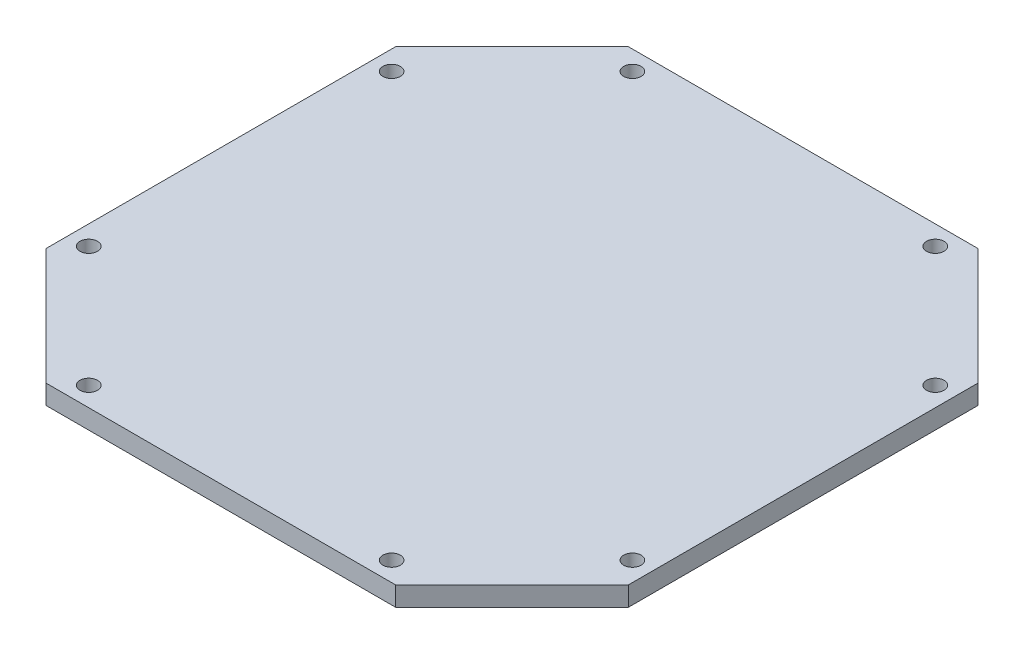
ISO-10303-21;
HEADER;
FILE_DESCRIPTION(('STEP AP214'),'2;1');
FILE_NAME('part.step','',(''),(''),'','','');
FILE_SCHEMA(('AUTOMOTIVE_DESIGN { 1 0 10303 214 1 1 1 1 }'));
ENDSEC;
DATA;
#1=APPLICATION_CONTEXT('core data for automotive mechanical design processes');
#2=APPLICATION_PROTOCOL_DEFINITION('international standard','automotive_design',2000,#1);
#3=PRODUCT_CONTEXT('',#1,'mechanical');
#4=PRODUCT('Part','Part','',(#3));
#5=PRODUCT_RELATED_PRODUCT_CATEGORY('part','',(#4));
#6=PRODUCT_DEFINITION_FORMATION('','',#4);
#7=PRODUCT_DEFINITION_CONTEXT('part definition',#1,'design');
#8=PRODUCT_DEFINITION('design','',#6,#7);
#9=PRODUCT_DEFINITION_SHAPE('','',#8);
#10=(LENGTH_UNIT() NAMED_UNIT(*) SI_UNIT(.MILLI.,.METRE.));
#11=(NAMED_UNIT(*) PLANE_ANGLE_UNIT() SI_UNIT($,.RADIAN.));
#12=(NAMED_UNIT(*) SI_UNIT($,.STERADIAN.) SOLID_ANGLE_UNIT());
#13=UNCERTAINTY_MEASURE_WITH_UNIT(LENGTH_MEASURE(1.E-05),#10,'distance_accuracy_value','');
#14=(GEOMETRIC_REPRESENTATION_CONTEXT(3) GLOBAL_UNCERTAINTY_ASSIGNED_CONTEXT((#13)) GLOBAL_UNIT_ASSIGNED_CONTEXT((#10,
#11,#12)) REPRESENTATION_CONTEXT('',''));
#15=CARTESIAN_POINT('',(0.,0.,0.));
#16=DIRECTION('',(0.,0.,1.));
#17=DIRECTION('',(1.,0.,0.));
#18=AXIS2_PLACEMENT_3D('',#15,#16,#17);
#19=CARTESIAN_POINT('',(-86.0912052117265,10.,-150.488599348534));
#20=DIRECTION('',(0.,0.,1.));
#21=DIRECTION('',(1.,0.,0.));
#22=AXIS2_PLACEMENT_3D('',#19,#20,#21);
#23=PLANE('',#22);
#24=DIRECTION('',(-1.,0.,0.));
#25=VECTOR('',#24,1.);
#26=CARTESIAN_POINT('',(-86.0912052117265,0.,-150.488599348534));
#27=LINE('',#26,#25);
#28=CARTESIAN_POINT('',(93.9087947882735,0.,-150.488599348534));
#29=VERTEX_POINT('',#28);
#30=CARTESIAN_POINT('',(-86.0912052117265,0.,-150.488599348534));
#31=VERTEX_POINT('',#30);
#32=EDGE_CURVE('E144',#29,#31,#27,.T.);
#33=ORIENTED_EDGE('',*,*,#32,.T.);
#34=DIRECTION('',(0.,-1.,0.));
#35=VECTOR('',#34,1.);
#36=CARTESIAN_POINT('',(-86.0912052117265,10.,-150.488599348534));
#37=LINE('',#36,#35);
#38=CARTESIAN_POINT('',(-86.0912052117265,10.,-150.488599348534));
#39=VERTEX_POINT('',#38);
#40=EDGE_CURVE('E11',#39,#31,#37,.T.);
#41=ORIENTED_EDGE('',*,*,#40,.F.);
#42=DIRECTION('',(-1.,0.,0.));
#43=VECTOR('',#42,1.);
#44=CARTESIAN_POINT('',(-86.0912052117265,10.,-150.488599348534));
#45=LINE('',#44,#43);
#46=CARTESIAN_POINT('',(93.9087947882735,10.,-150.488599348534));
#47=VERTEX_POINT('',#46);
#48=EDGE_CURVE('E167',#47,#39,#45,.T.);
#49=ORIENTED_EDGE('',*,*,#48,.F.);
#50=DIRECTION('',(0.,-1.,0.));
#51=VECTOR('',#50,1.);
#52=CARTESIAN_POINT('',(93.9087947882735,10.,-150.488599348534));
#53=LINE('',#52,#51);
#54=EDGE_CURVE('E140',#47,#29,#53,.T.);
#55=ORIENTED_EDGE('',*,*,#54,.T.);
#56=EDGE_LOOP('',(#33,#41,#49,#55));
#57=FACE_BOUND('',#56,.T.);
#58=ADVANCED_FACE('F43',(#57),#23,.F.);
#59=CARTESIAN_POINT('',(-146.091205211726,10.,-90.4885993485344));
#60=DIRECTION('',(0.707106781186546,0.,0.707106781186549));
#61=DIRECTION('',(0.707106781186549,0.,-0.707106781186546));
#62=AXIS2_PLACEMENT_3D('',#59,#60,#61);
#63=PLANE('',#62);
#64=DIRECTION('',(-0.707106781186549,0.,0.707106781186546));
#65=VECTOR('',#64,1.);
#66=CARTESIAN_POINT('',(-146.091205211726,0.,-90.4885993485344));
#67=LINE('',#66,#65);
#68=CARTESIAN_POINT('',(-146.091205211726,0.,-90.4885993485344));
#69=VERTEX_POINT('',#68);
#70=EDGE_CURVE('E148',#31,#69,#67,.T.);
#71=ORIENTED_EDGE('',*,*,#70,.T.);
#72=DIRECTION('',(0.,-1.,0.));
#73=VECTOR('',#72,1.);
#74=CARTESIAN_POINT('',(-146.091205211726,10.,-90.4885993485344));
#75=LINE('',#74,#73);
#76=CARTESIAN_POINT('',(-146.091205211726,10.,-90.4885993485344));
#77=VERTEX_POINT('',#76);
#78=EDGE_CURVE('E52',#77,#69,#75,.T.);
#79=ORIENTED_EDGE('',*,*,#78,.F.);
#80=DIRECTION('',(-0.707106781186549,0.,0.707106781186546));
#81=VECTOR('',#80,1.);
#82=CARTESIAN_POINT('',(-146.091205211726,10.,-90.4885993485344));
#83=LINE('',#82,#81);
#84=EDGE_CURVE('E103',#39,#77,#83,.T.);
#85=ORIENTED_EDGE('',*,*,#84,.F.);
#86=ORIENTED_EDGE('',*,*,#40,.T.);
#87=EDGE_LOOP('',(#71,#79,#85,#86));
#88=FACE_BOUND('',#87,.T.);
#89=ADVANCED_FACE('F311',(#88),#63,.F.);
#90=CARTESIAN_POINT('',(-146.091205211726,10.,-90.4885993485344));
#91=DIRECTION('',(1.,0.,0.));
#92=DIRECTION('',(0.,0.,-1.));
#93=AXIS2_PLACEMENT_3D('',#90,#91,#92);
#94=PLANE('',#93);
#95=DIRECTION('',(0.,0.,1.));
#96=VECTOR('',#95,1.);
#97=CARTESIAN_POINT('',(-146.091205211726,0.,-90.4885993485344));
#98=LINE('',#97,#96);
#99=CARTESIAN_POINT('',(-146.091205211726,0.,89.5114006514658));
#100=VERTEX_POINT('',#99);
#101=EDGE_CURVE('E152',#69,#100,#98,.T.);
#102=ORIENTED_EDGE('',*,*,#101,.T.);
#103=DIRECTION('',(0.,-1.,0.));
#104=VECTOR('',#103,1.);
#105=CARTESIAN_POINT('',(-146.091205211726,10.,89.5114006514658));
#106=LINE('',#105,#104);
#107=CARTESIAN_POINT('',(-146.091205211726,10.,89.5114006514658));
#108=VERTEX_POINT('',#107);
#109=EDGE_CURVE('E178',#108,#100,#106,.T.);
#110=ORIENTED_EDGE('',*,*,#109,.F.);
#111=DIRECTION('',(0.,0.,1.));
#112=VECTOR('',#111,1.);
#113=CARTESIAN_POINT('',(-146.091205211726,10.,-90.4885993485344));
#114=LINE('',#113,#112);
#115=EDGE_CURVE('E188',#77,#108,#114,.T.);
#116=ORIENTED_EDGE('',*,*,#115,.F.);
#117=ORIENTED_EDGE('',*,*,#78,.T.);
#118=EDGE_LOOP('',(#102,#110,#116,#117));
#119=FACE_BOUND('',#118,.T.);
#120=ADVANCED_FACE('F186',(#119),#94,.F.);
#121=CARTESIAN_POINT('',(-146.091205211726,10.,89.5114006514658));
#122=DIRECTION('',(0.707106781186549,0.,-0.707106781186546));
#123=DIRECTION('',(-0.707106781186546,0.,-0.707106781186549));
#124=AXIS2_PLACEMENT_3D('',#121,#122,#123);
#125=PLANE('',#124);
#126=DIRECTION('',(0.707106781186546,0.,0.707106781186549));
#127=VECTOR('',#126,1.);
#128=CARTESIAN_POINT('',(-146.091205211726,0.,89.5114006514658));
#129=LINE('',#128,#127);
#130=CARTESIAN_POINT('',(-86.0912052117266,0.,149.511400651466));
#131=VERTEX_POINT('',#130);
#132=EDGE_CURVE('E155',#100,#131,#129,.T.);
#133=ORIENTED_EDGE('',*,*,#132,.T.);
#134=DIRECTION('',(0.,-1.,0.));
#135=VECTOR('',#134,1.);
#136=CARTESIAN_POINT('',(-86.0912052117266,10.,149.511400651466));
#137=LINE('',#136,#135);
#138=CARTESIAN_POINT('',(-86.0912052117266,10.,149.511400651466));
#139=VERTEX_POINT('',#138);
#140=EDGE_CURVE('E174',#139,#131,#137,.T.);
#141=ORIENTED_EDGE('',*,*,#140,.F.);
#142=DIRECTION('',(0.707106781186546,0.,0.707106781186549));
#143=VECTOR('',#142,1.);
#144=CARTESIAN_POINT('',(-146.091205211726,10.,89.5114006514658));
#145=LINE('',#144,#143);
#146=EDGE_CURVE('E201',#108,#139,#145,.T.);
#147=ORIENTED_EDGE('',*,*,#146,.F.);
#148=ORIENTED_EDGE('',*,*,#109,.T.);
#149=EDGE_LOOP('',(#133,#141,#147,#148));
#150=FACE_BOUND('',#149,.T.);
#151=ADVANCED_FACE('F196',(#150),#125,.F.);
#152=CARTESIAN_POINT('',(-86.0912052117266,10.,149.511400651466));
#153=DIRECTION('',(0.,0.,-1.));
#154=DIRECTION('',(-1.,0.,0.));
#155=AXIS2_PLACEMENT_3D('',#152,#153,#154);
#156=PLANE('',#155);
#157=DIRECTION('',(1.,0.,0.));
#158=VECTOR('',#157,1.);
#159=CARTESIAN_POINT('',(-86.0912052117266,0.,149.511400651466));
#160=LINE('',#159,#158);
#161=CARTESIAN_POINT('',(93.9087947882736,0.,149.511400651466));
#162=VERTEX_POINT('',#161);
#163=EDGE_CURVE('E158',#131,#162,#160,.T.);
#164=ORIENTED_EDGE('',*,*,#163,.T.);
#165=DIRECTION('',(0.,-1.,0.));
#166=VECTOR('',#165,1.);
#167=CARTESIAN_POINT('',(93.9087947882736,10.,149.511400651466));
#168=LINE('',#167,#166);
#169=CARTESIAN_POINT('',(93.9087947882736,10.,149.511400651466));
#170=VERTEX_POINT('',#169);
#171=EDGE_CURVE('E133',#170,#162,#168,.T.);
#172=ORIENTED_EDGE('',*,*,#171,.F.);
#173=DIRECTION('',(1.,0.,0.));
#174=VECTOR('',#173,1.);
#175=CARTESIAN_POINT('',(-86.0912052117266,10.,149.511400651466));
#176=LINE('',#175,#174);
#177=EDGE_CURVE('E122',#139,#170,#176,.T.);
#178=ORIENTED_EDGE('',*,*,#177,.F.);
#179=ORIENTED_EDGE('',*,*,#140,.T.);
#180=EDGE_LOOP('',(#164,#172,#178,#179));
#181=FACE_BOUND('',#180,.T.);
#182=ADVANCED_FACE('F199',(#181),#156,.F.);
#183=CARTESIAN_POINT('',(93.9087947882736,10.,149.511400651466));
#184=DIRECTION('',(-0.707106781186546,0.,-0.707106781186549));
#185=DIRECTION('',(-0.707106781186549,0.,0.707106781186546));
#186=AXIS2_PLACEMENT_3D('',#183,#184,#185);
#187=PLANE('',#186);
#188=DIRECTION('',(0.707106781186549,0.,-0.707106781186546));
#189=VECTOR('',#188,1.);
#190=CARTESIAN_POINT('',(93.9087947882736,0.,149.511400651466));
#191=LINE('',#190,#189);
#192=CARTESIAN_POINT('',(153.908794788274,0.,89.511400651466));
#193=VERTEX_POINT('',#192);
#194=EDGE_CURVE('E131',#162,#193,#191,.T.);
#195=ORIENTED_EDGE('',*,*,#194,.T.);
#196=DIRECTION('',(0.,-1.,0.));
#197=VECTOR('',#196,1.);
#198=CARTESIAN_POINT('',(153.908794788274,10.,89.511400651466));
#199=LINE('',#198,#197);
#200=CARTESIAN_POINT('',(153.908794788274,10.,89.511400651466));
#201=VERTEX_POINT('',#200);
#202=EDGE_CURVE('E128',#201,#193,#199,.T.);
#203=ORIENTED_EDGE('',*,*,#202,.F.);
#204=DIRECTION('',(0.707106781186549,0.,-0.707106781186546));
#205=VECTOR('',#204,1.);
#206=CARTESIAN_POINT('',(93.9087947882736,10.,149.511400651466));
#207=LINE('',#206,#205);
#208=EDGE_CURVE('E116',#170,#201,#207,.T.);
#209=ORIENTED_EDGE('',*,*,#208,.F.);
#210=ORIENTED_EDGE('',*,*,#171,.T.);
#211=EDGE_LOOP('',(#195,#203,#209,#210));
#212=FACE_BOUND('',#211,.T.);
#213=ADVANCED_FACE('F129',(#212),#187,.F.);
#214=CARTESIAN_POINT('',(153.908794788274,10.,-90.4885993485344));
#215=DIRECTION('',(-1.,0.,0.));
#216=DIRECTION('',(0.,0.,1.));
#217=AXIS2_PLACEMENT_3D('',#214,#215,#216);
#218=PLANE('',#217);
#219=DIRECTION('',(0.,0.,-1.));
#220=VECTOR('',#219,1.);
#221=CARTESIAN_POINT('',(153.908794788274,0.,-90.4885993485344));
#222=LINE('',#221,#220);
#223=CARTESIAN_POINT('',(153.908794788274,0.,-90.4885993485344));
#224=VERTEX_POINT('',#223);
#225=EDGE_CURVE('E89',#193,#224,#222,.T.);
#226=ORIENTED_EDGE('',*,*,#225,.T.);
#227=DIRECTION('',(0.,-1.,0.));
#228=VECTOR('',#227,1.);
#229=CARTESIAN_POINT('',(153.908794788274,10.,-90.4885993485344));
#230=LINE('',#229,#228);
#231=CARTESIAN_POINT('',(153.908794788274,10.,-90.4885993485344));
#232=VERTEX_POINT('',#231);
#233=EDGE_CURVE('E134',#232,#224,#230,.T.);
#234=ORIENTED_EDGE('',*,*,#233,.F.);
#235=DIRECTION('',(0.,0.,-1.));
#236=VECTOR('',#235,1.);
#237=CARTESIAN_POINT('',(153.908794788274,10.,-90.4885993485344));
#238=LINE('',#237,#236);
#239=EDGE_CURVE('E120',#201,#232,#238,.T.);
#240=ORIENTED_EDGE('',*,*,#239,.F.);
#241=ORIENTED_EDGE('',*,*,#202,.T.);
#242=EDGE_LOOP('',(#226,#234,#240,#241));
#243=FACE_BOUND('',#242,.T.);
#244=ADVANCED_FACE('F136',(#243),#218,.F.);
#245=CARTESIAN_POINT('',(93.9087947882735,10.,-150.488599348534));
#246=DIRECTION('',(-0.707106781186546,0.,0.707106781186549));
#247=DIRECTION('',(0.707106781186549,0.,0.707106781186546));
#248=AXIS2_PLACEMENT_3D('',#245,#246,#247);
#249=PLANE('',#248);
#250=DIRECTION('',(-0.707106781186549,0.,-0.707106781186546));
#251=VECTOR('',#250,1.);
#252=CARTESIAN_POINT('',(93.9087947882735,0.,-150.488599348534));
#253=LINE('',#252,#251);
#254=EDGE_CURVE('E95',#224,#29,#253,.T.);
#255=ORIENTED_EDGE('',*,*,#254,.T.);
#256=ORIENTED_EDGE('',*,*,#54,.F.);
#257=DIRECTION('',(-0.707106781186549,0.,-0.707106781186546));
#258=VECTOR('',#257,1.);
#259=CARTESIAN_POINT('',(93.9087947882735,10.,-150.488599348534));
#260=LINE('',#259,#258);
#261=EDGE_CURVE('E60',#232,#47,#260,.T.);
#262=ORIENTED_EDGE('',*,*,#261,.F.);
#263=ORIENTED_EDGE('',*,*,#233,.T.);
#264=EDGE_LOOP('',(#255,#256,#262,#263));
#265=FACE_BOUND('',#264,.T.);
#266=ADVANCED_FACE('F279',(#265),#249,.F.);
#267=CARTESIAN_POINT('',(0.,10.,0.));
#268=DIRECTION('',(0.,-1.,0.));
#269=DIRECTION('',(0.,0.,-1.));
#270=AXIS2_PLACEMENT_3D('',#267,#268,#269);
#271=PLANE('',#270);
#272=CARTESIAN_POINT('',(-136.091205211726,10.,-78.4885993485342));
#273=DIRECTION('',(0.,1.,0.));
#274=DIRECTION('',(0.,0.,1.));
#275=AXIS2_PLACEMENT_3D('',#272,#273,#274);
#276=CIRCLE('',#275,4.5);
#277=CARTESIAN_POINT('',(-136.091205211726,10.,-73.9885993485342));
#278=VERTEX_POINT('',#277);
#279=EDGE_CURVE('E270',#278,#278,#276,.T.);
#280=ORIENTED_EDGE('',*,*,#279,.F.);
#281=EDGE_LOOP('',(#280));
#282=FACE_BOUND('',#281,.T.);
#283=CARTESIAN_POINT('',(-74.0912052117264,10.,-140.488599348534));
#284=DIRECTION('',(0.,1.,0.));
#285=DIRECTION('',(0.,0.,1.));
#286=AXIS2_PLACEMENT_3D('',#283,#284,#285);
#287=CIRCLE('',#286,4.5);
#288=CARTESIAN_POINT('',(-74.0912052117264,10.,-135.988599348534));
#289=VERTEX_POINT('',#288);
#290=EDGE_CURVE('E262',#289,#289,#287,.T.);
#291=ORIENTED_EDGE('',*,*,#290,.F.);
#292=EDGE_LOOP('',(#291));
#293=FACE_BOUND('',#292,.T.);
#294=CARTESIAN_POINT('',(81.9087947882735,10.,-140.488599348534));
#295=DIRECTION('',(0.,1.,0.));
#296=DIRECTION('',(0.,0.,1.));
#297=AXIS2_PLACEMENT_3D('',#294,#295,#296);
#298=CIRCLE('',#297,4.5);
#299=CARTESIAN_POINT('',(81.9087947882735,10.,-135.988599348534));
#300=VERTEX_POINT('',#299);
#301=EDGE_CURVE('E254',#300,#300,#298,.T.);
#302=ORIENTED_EDGE('',*,*,#301,.F.);
#303=EDGE_LOOP('',(#302));
#304=FACE_BOUND('',#303,.T.);
#305=CARTESIAN_POINT('',(143.908794788274,10.,-78.4885993485342));
#306=DIRECTION('',(0.,1.,0.));
#307=DIRECTION('',(0.,0.,1.));
#308=AXIS2_PLACEMENT_3D('',#305,#306,#307);
#309=CIRCLE('',#308,4.5);
#310=CARTESIAN_POINT('',(143.908794788274,10.,-73.9885993485342));
#311=VERTEX_POINT('',#310);
#312=EDGE_CURVE('E246',#311,#311,#309,.T.);
#313=ORIENTED_EDGE('',*,*,#312,.F.);
#314=EDGE_LOOP('',(#313));
#315=FACE_BOUND('',#314,.T.);
#316=CARTESIAN_POINT('',(143.908794788274,10.,77.5114006514658));
#317=DIRECTION('',(0.,1.,0.));
#318=DIRECTION('',(0.,0.,1.));
#319=AXIS2_PLACEMENT_3D('',#316,#317,#318);
#320=CIRCLE('',#319,4.5);
#321=CARTESIAN_POINT('',(143.908794788274,10.,82.0114006514658));
#322=VERTEX_POINT('',#321);
#323=EDGE_CURVE('E238',#322,#322,#320,.T.);
#324=ORIENTED_EDGE('',*,*,#323,.F.);
#325=EDGE_LOOP('',(#324));
#326=FACE_BOUND('',#325,.T.);
#327=CARTESIAN_POINT('',(81.9087947882735,10.,139.511400651466));
#328=DIRECTION('',(0.,1.,0.));
#329=DIRECTION('',(0.,0.,1.));
#330=AXIS2_PLACEMENT_3D('',#327,#328,#329);
#331=CIRCLE('',#330,4.5);
#332=CARTESIAN_POINT('',(81.9087947882735,10.,144.011400651466));
#333=VERTEX_POINT('',#332);
#334=EDGE_CURVE('E230',#333,#333,#331,.T.);
#335=ORIENTED_EDGE('',*,*,#334,.F.);
#336=EDGE_LOOP('',(#335));
#337=FACE_BOUND('',#336,.T.);
#338=CARTESIAN_POINT('',(-74.0912052117264,10.,139.511400651466));
#339=DIRECTION('',(0.,1.,0.));
#340=DIRECTION('',(0.,0.,1.));
#341=AXIS2_PLACEMENT_3D('',#338,#339,#340);
#342=CIRCLE('',#341,4.5);
#343=CARTESIAN_POINT('',(-74.0912052117264,10.,144.011400651466));
#344=VERTEX_POINT('',#343);
#345=EDGE_CURVE('E222',#344,#344,#342,.T.);
#346=ORIENTED_EDGE('',*,*,#345,.F.);
#347=EDGE_LOOP('',(#346));
#348=FACE_BOUND('',#347,.T.);
#349=CARTESIAN_POINT('',(-136.091205211726,10.,77.5114006514658));
#350=DIRECTION('',(0.,1.,0.));
#351=DIRECTION('',(0.,0.,1.));
#352=AXIS2_PLACEMENT_3D('',#349,#350,#351);
#353=CIRCLE('',#352,4.5);
#354=CARTESIAN_POINT('',(-136.091205211726,10.,82.0114006514658));
#355=VERTEX_POINT('',#354);
#356=EDGE_CURVE('E214',#355,#355,#353,.T.);
#357=ORIENTED_EDGE('',*,*,#356,.F.);
#358=EDGE_LOOP('',(#357));
#359=FACE_BOUND('',#358,.T.);
#360=ORIENTED_EDGE('',*,*,#48,.T.);
#361=ORIENTED_EDGE('',*,*,#84,.T.);
#362=ORIENTED_EDGE('',*,*,#115,.T.);
#363=ORIENTED_EDGE('',*,*,#146,.T.);
#364=ORIENTED_EDGE('',*,*,#177,.T.);
#365=ORIENTED_EDGE('',*,*,#208,.T.);
#366=ORIENTED_EDGE('',*,*,#239,.T.);
#367=ORIENTED_EDGE('',*,*,#261,.T.);
#368=EDGE_LOOP('',(#360,#361,#362,#363,#364,#365,#366,#367));
#369=FACE_BOUND('',#368,.T.);
#370=ADVANCED_FACE('F118',(#282,#293,#304,#315,#326,#337,#348,#359,#369),#271,.F.);
#371=CARTESIAN_POINT('',(0.,0.,0.));
#372=DIRECTION('',(0.,-1.,0.));
#373=DIRECTION('',(0.,0.,-1.));
#374=AXIS2_PLACEMENT_3D('',#371,#372,#373);
#375=PLANE('',#374);
#376=CARTESIAN_POINT('',(-136.091205211726,0.,-78.4885993485342));
#377=DIRECTION('',(0.,1.,0.));
#378=DIRECTION('',(0.,0.,1.));
#379=AXIS2_PLACEMENT_3D('',#376,#377,#378);
#380=CIRCLE('',#379,4.5);
#381=CARTESIAN_POINT('',(-136.091205211726,0.,-73.9885993485342));
#382=VERTEX_POINT('',#381);
#383=EDGE_CURVE('E266',#382,#382,#380,.T.);
#384=ORIENTED_EDGE('',*,*,#383,.T.);
#385=EDGE_LOOP('',(#384));
#386=FACE_BOUND('',#385,.T.);
#387=CARTESIAN_POINT('',(-74.0912052117264,0.,-140.488599348534));
#388=DIRECTION('',(0.,1.,0.));
#389=DIRECTION('',(0.,0.,1.));
#390=AXIS2_PLACEMENT_3D('',#387,#388,#389);
#391=CIRCLE('',#390,4.5);
#392=CARTESIAN_POINT('',(-74.0912052117264,0.,-135.988599348534));
#393=VERTEX_POINT('',#392);
#394=EDGE_CURVE('E258',#393,#393,#391,.T.);
#395=ORIENTED_EDGE('',*,*,#394,.T.);
#396=EDGE_LOOP('',(#395));
#397=FACE_BOUND('',#396,.T.);
#398=CARTESIAN_POINT('',(81.9087947882735,0.,-140.488599348534));
#399=DIRECTION('',(0.,1.,0.));
#400=DIRECTION('',(0.,0.,1.));
#401=AXIS2_PLACEMENT_3D('',#398,#399,#400);
#402=CIRCLE('',#401,4.5);
#403=CARTESIAN_POINT('',(81.9087947882735,0.,-135.988599348534));
#404=VERTEX_POINT('',#403);
#405=EDGE_CURVE('E250',#404,#404,#402,.T.);
#406=ORIENTED_EDGE('',*,*,#405,.T.);
#407=EDGE_LOOP('',(#406));
#408=FACE_BOUND('',#407,.T.);
#409=CARTESIAN_POINT('',(143.908794788274,0.,-78.4885993485342));
#410=DIRECTION('',(0.,1.,0.));
#411=DIRECTION('',(0.,0.,1.));
#412=AXIS2_PLACEMENT_3D('',#409,#410,#411);
#413=CIRCLE('',#412,4.5);
#414=CARTESIAN_POINT('',(143.908794788274,0.,-73.9885993485342));
#415=VERTEX_POINT('',#414);
#416=EDGE_CURVE('E242',#415,#415,#413,.T.);
#417=ORIENTED_EDGE('',*,*,#416,.T.);
#418=EDGE_LOOP('',(#417));
#419=FACE_BOUND('',#418,.T.);
#420=CARTESIAN_POINT('',(143.908794788274,0.,77.5114006514658));
#421=DIRECTION('',(0.,1.,0.));
#422=DIRECTION('',(0.,0.,1.));
#423=AXIS2_PLACEMENT_3D('',#420,#421,#422);
#424=CIRCLE('',#423,4.5);
#425=CARTESIAN_POINT('',(143.908794788274,0.,82.0114006514658));
#426=VERTEX_POINT('',#425);
#427=EDGE_CURVE('E234',#426,#426,#424,.T.);
#428=ORIENTED_EDGE('',*,*,#427,.T.);
#429=EDGE_LOOP('',(#428));
#430=FACE_BOUND('',#429,.T.);
#431=CARTESIAN_POINT('',(81.9087947882735,0.,139.511400651466));
#432=DIRECTION('',(0.,1.,0.));
#433=DIRECTION('',(0.,0.,1.));
#434=AXIS2_PLACEMENT_3D('',#431,#432,#433);
#435=CIRCLE('',#434,4.5);
#436=CARTESIAN_POINT('',(81.9087947882735,0.,144.011400651466));
#437=VERTEX_POINT('',#436);
#438=EDGE_CURVE('E226',#437,#437,#435,.T.);
#439=ORIENTED_EDGE('',*,*,#438,.T.);
#440=EDGE_LOOP('',(#439));
#441=FACE_BOUND('',#440,.T.);
#442=CARTESIAN_POINT('',(-74.0912052117264,0.,139.511400651466));
#443=DIRECTION('',(0.,1.,0.));
#444=DIRECTION('',(0.,0.,1.));
#445=AXIS2_PLACEMENT_3D('',#442,#443,#444);
#446=CIRCLE('',#445,4.5);
#447=CARTESIAN_POINT('',(-74.0912052117264,0.,144.011400651466));
#448=VERTEX_POINT('',#447);
#449=EDGE_CURVE('E218',#448,#448,#446,.T.);
#450=ORIENTED_EDGE('',*,*,#449,.T.);
#451=EDGE_LOOP('',(#450));
#452=FACE_BOUND('',#451,.T.);
#453=CARTESIAN_POINT('',(-136.091205211726,0.,77.5114006514658));
#454=DIRECTION('',(0.,1.,0.));
#455=DIRECTION('',(0.,0.,1.));
#456=AXIS2_PLACEMENT_3D('',#453,#454,#455);
#457=CIRCLE('',#456,4.5);
#458=CARTESIAN_POINT('',(-136.091205211726,0.,82.0114006514658));
#459=VERTEX_POINT('',#458);
#460=EDGE_CURVE('E149',#459,#459,#457,.T.);
#461=ORIENTED_EDGE('',*,*,#460,.T.);
#462=EDGE_LOOP('',(#461));
#463=FACE_BOUND('',#462,.T.);
#464=ORIENTED_EDGE('',*,*,#32,.F.);
#465=ORIENTED_EDGE('',*,*,#254,.F.);
#466=ORIENTED_EDGE('',*,*,#225,.F.);
#467=ORIENTED_EDGE('',*,*,#194,.F.);
#468=ORIENTED_EDGE('',*,*,#163,.F.);
#469=ORIENTED_EDGE('',*,*,#132,.F.);
#470=ORIENTED_EDGE('',*,*,#101,.F.);
#471=ORIENTED_EDGE('',*,*,#70,.F.);
#472=EDGE_LOOP('',(#464,#465,#466,#467,#468,#469,#470,#471));
#473=FACE_BOUND('',#472,.T.);
#474=ADVANCED_FACE('F192',(#386,#397,#408,#419,#430,#441,#452,#463,#473),#375,.T.);
#475=CARTESIAN_POINT('',(-136.091205211726,10.,77.5114006514658));
#476=DIRECTION('',(0.,1.,0.));
#477=DIRECTION('',(0.,0.,1.));
#478=AXIS2_PLACEMENT_3D('',#475,#476,#477);
#479=CYLINDRICAL_SURFACE('',#478,4.5);
#480=ORIENTED_EDGE('',*,*,#460,.F.);
#481=EDGE_LOOP('',(#480));
#482=FACE_BOUND('',#481,.T.);
#483=ORIENTED_EDGE('',*,*,#356,.T.);
#484=EDGE_LOOP('',(#483));
#485=FACE_BOUND('',#484,.T.);
#486=ADVANCED_FACE('F295',(#482,#485),#479,.F.);
#487=CARTESIAN_POINT('',(-74.0912052117264,10.,139.511400651466));
#488=DIRECTION('',(0.,1.,0.));
#489=DIRECTION('',(0.,0.,1.));
#490=AXIS2_PLACEMENT_3D('',#487,#488,#489);
#491=CYLINDRICAL_SURFACE('',#490,4.5);
#492=ORIENTED_EDGE('',*,*,#449,.F.);
#493=EDGE_LOOP('',(#492));
#494=FACE_BOUND('',#493,.T.);
#495=ORIENTED_EDGE('',*,*,#345,.T.);
#496=EDGE_LOOP('',(#495));
#497=FACE_BOUND('',#496,.T.);
#498=ADVANCED_FACE('F297',(#494,#497),#491,.F.);
#499=CARTESIAN_POINT('',(81.9087947882735,10.,139.511400651466));
#500=DIRECTION('',(0.,1.,0.));
#501=DIRECTION('',(0.,0.,1.));
#502=AXIS2_PLACEMENT_3D('',#499,#500,#501);
#503=CYLINDRICAL_SURFACE('',#502,4.5);
#504=ORIENTED_EDGE('',*,*,#438,.F.);
#505=EDGE_LOOP('',(#504));
#506=FACE_BOUND('',#505,.T.);
#507=ORIENTED_EDGE('',*,*,#334,.T.);
#508=EDGE_LOOP('',(#507));
#509=FACE_BOUND('',#508,.T.);
#510=ADVANCED_FACE('F304',(#506,#509),#503,.F.);
#511=CARTESIAN_POINT('',(143.908794788274,10.,77.5114006514658));
#512=DIRECTION('',(0.,1.,0.));
#513=DIRECTION('',(0.,0.,1.));
#514=AXIS2_PLACEMENT_3D('',#511,#512,#513);
#515=CYLINDRICAL_SURFACE('',#514,4.5);
#516=ORIENTED_EDGE('',*,*,#427,.F.);
#517=EDGE_LOOP('',(#516));
#518=FACE_BOUND('',#517,.T.);
#519=ORIENTED_EDGE('',*,*,#323,.T.);
#520=EDGE_LOOP('',(#519));
#521=FACE_BOUND('',#520,.T.);
#522=ADVANCED_FACE('F393',(#518,#521),#515,.F.);
#523=CARTESIAN_POINT('',(143.908794788274,10.,-78.4885993485342));
#524=DIRECTION('',(0.,1.,0.));
#525=DIRECTION('',(0.,0.,1.));
#526=AXIS2_PLACEMENT_3D('',#523,#524,#525);
#527=CYLINDRICAL_SURFACE('',#526,4.5);
#528=ORIENTED_EDGE('',*,*,#416,.F.);
#529=EDGE_LOOP('',(#528));
#530=FACE_BOUND('',#529,.T.);
#531=ORIENTED_EDGE('',*,*,#312,.T.);
#532=EDGE_LOOP('',(#531));
#533=FACE_BOUND('',#532,.T.);
#534=ADVANCED_FACE('F404',(#530,#533),#527,.F.);
#535=CARTESIAN_POINT('',(81.9087947882735,10.,-140.488599348534));
#536=DIRECTION('',(0.,1.,0.));
#537=DIRECTION('',(0.,0.,1.));
#538=AXIS2_PLACEMENT_3D('',#535,#536,#537);
#539=CYLINDRICAL_SURFACE('',#538,4.5);
#540=ORIENTED_EDGE('',*,*,#405,.F.);
#541=EDGE_LOOP('',(#540));
#542=FACE_BOUND('',#541,.T.);
#543=ORIENTED_EDGE('',*,*,#301,.T.);
#544=EDGE_LOOP('',(#543));
#545=FACE_BOUND('',#544,.T.);
#546=ADVANCED_FACE('F415',(#542,#545),#539,.F.);
#547=CARTESIAN_POINT('',(-74.0912052117264,10.,-140.488599348534));
#548=DIRECTION('',(0.,1.,0.));
#549=DIRECTION('',(0.,0.,1.));
#550=AXIS2_PLACEMENT_3D('',#547,#548,#549);
#551=CYLINDRICAL_SURFACE('',#550,4.5);
#552=ORIENTED_EDGE('',*,*,#394,.F.);
#553=EDGE_LOOP('',(#552));
#554=FACE_BOUND('',#553,.T.);
#555=ORIENTED_EDGE('',*,*,#290,.T.);
#556=EDGE_LOOP('',(#555));
#557=FACE_BOUND('',#556,.T.);
#558=ADVANCED_FACE('F426',(#554,#557),#551,.F.);
#559=CARTESIAN_POINT('',(-136.091205211726,10.,-78.4885993485342));
#560=DIRECTION('',(0.,1.,0.));
#561=DIRECTION('',(0.,0.,1.));
#562=AXIS2_PLACEMENT_3D('',#559,#560,#561);
#563=CYLINDRICAL_SURFACE('',#562,4.5);
#564=ORIENTED_EDGE('',*,*,#383,.F.);
#565=EDGE_LOOP('',(#564));
#566=FACE_BOUND('',#565,.T.);
#567=ORIENTED_EDGE('',*,*,#279,.T.);
#568=EDGE_LOOP('',(#567));
#569=FACE_BOUND('',#568,.T.);
#570=ADVANCED_FACE('F275',(#566,#569),#563,.F.);
#571=CLOSED_SHELL('',(#58,#89,#120,#151,#182,#213,#244,#266,#370,#474,#486,#498,#510,#522,#534,
#546,#558,#570));
#572=MANIFOLD_SOLID_BREP('B2',#571);
#573=ADVANCED_BREP_SHAPE_REPRESENTATION('',(#18,#572),#14);
#574=SHAPE_DEFINITION_REPRESENTATION(#9,#573);
ENDSEC;
END-ISO-10303-21;
